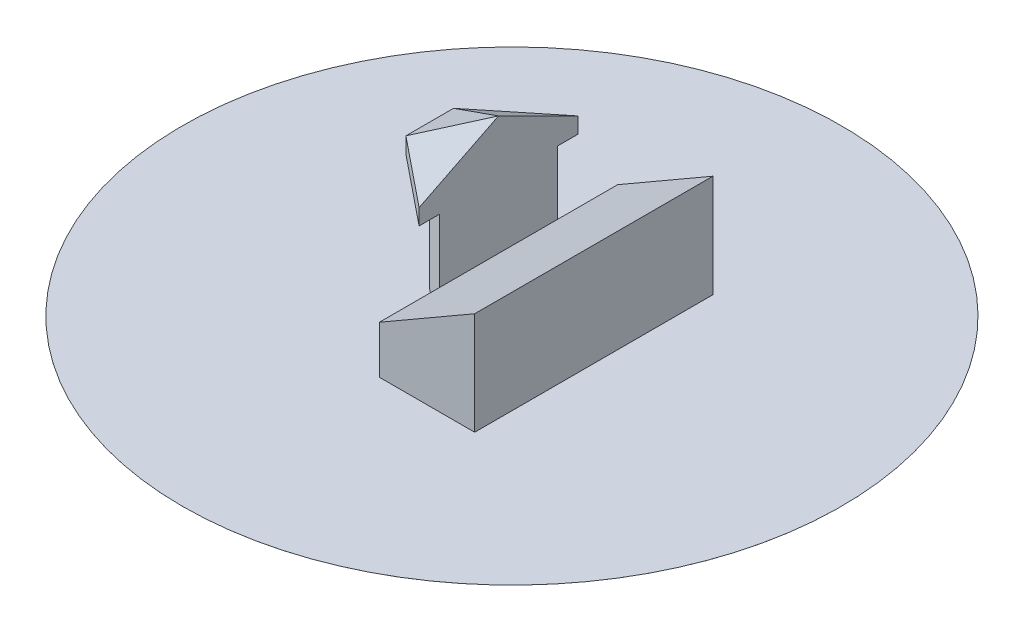
ISO-10303-21;
HEADER;
FILE_DESCRIPTION(('STEP AP214'),'2;1');
FILE_NAME('part.step','',(''),(''),'','','');
FILE_SCHEMA(('AUTOMOTIVE_DESIGN { 1 0 10303 214 1 1 1 1 }'));
ENDSEC;
DATA;
#1=APPLICATION_CONTEXT('core data for automotive mechanical design processes');
#2=APPLICATION_PROTOCOL_DEFINITION('international standard','automotive_design',2000,#1);
#3=PRODUCT_CONTEXT('',#1,'mechanical');
#4=PRODUCT('Part','Part','',(#3));
#5=PRODUCT_RELATED_PRODUCT_CATEGORY('part','',(#4));
#6=PRODUCT_DEFINITION_FORMATION('','',#4);
#7=PRODUCT_DEFINITION_CONTEXT('part definition',#1,'design');
#8=PRODUCT_DEFINITION('design','',#6,#7);
#9=PRODUCT_DEFINITION_SHAPE('','',#8);
#10=(LENGTH_UNIT() NAMED_UNIT(*) SI_UNIT(.MILLI.,.METRE.));
#11=(NAMED_UNIT(*) PLANE_ANGLE_UNIT() SI_UNIT($,.RADIAN.));
#12=(NAMED_UNIT(*) SI_UNIT($,.STERADIAN.) SOLID_ANGLE_UNIT());
#13=UNCERTAINTY_MEASURE_WITH_UNIT(LENGTH_MEASURE(1.E-05),#10,'distance_accuracy_value','');
#14=(GEOMETRIC_REPRESENTATION_CONTEXT(3) GLOBAL_UNCERTAINTY_ASSIGNED_CONTEXT((#13)) GLOBAL_UNIT_ASSIGNED_CONTEXT((#10,
#11,#12)) REPRESENTATION_CONTEXT('',''));
#15=CARTESIAN_POINT('',(0.,0.,0.));
#16=DIRECTION('',(0.,0.,1.));
#17=DIRECTION('',(1.,0.,0.));
#18=AXIS2_PLACEMENT_3D('',#15,#16,#17);
#19=CARTESIAN_POINT('',(0.,0.,75.));
#20=DIRECTION('',(1.,0.,0.));
#21=DIRECTION('',(0.,0.,-1.));
#22=AXIS2_PLACEMENT_3D('',#19,#20,#21);
#23=PLANE('',#22);
#24=DIRECTION('',(0.,-1.,0.));
#25=VECTOR('',#24,1.);
#26=CARTESIAN_POINT('',(0.,0.,-75.));
#27=LINE('',#26,#25);
#28=CARTESIAN_POINT('',(0.,30.,-75.));
#29=VERTEX_POINT('',#28);
#30=CARTESIAN_POINT('',(0.,0.01,-75.));
#31=VERTEX_POINT('',#30);
#32=EDGE_CURVE('E192',#29,#31,#27,.T.);
#33=ORIENTED_EDGE('',*,*,#32,.T.);
#34=DIRECTION('',(0.,0.,1.));
#35=VECTOR('',#34,1.);
#36=CARTESIAN_POINT('',(0.,0.01,75.));
#37=LINE('',#36,#35);
#38=CARTESIAN_POINT('',(0.,0.0100000000000031,-37.1417989853427));
#39=VERTEX_POINT('',#38);
#40=EDGE_CURVE('E257',#31,#39,#37,.T.);
#41=ORIENTED_EDGE('',*,*,#40,.T.);
#42=DIRECTION('',(0.,-1.,0.));
#43=VECTOR('',#42,1.);
#44=CARTESIAN_POINT('',(0.,70.,-37.1417989853427));
#45=LINE('',#44,#43);
#46=CARTESIAN_POINT('',(0.,30.,-37.1417989853427));
#47=VERTEX_POINT('',#46);
#48=EDGE_CURVE('E42',#47,#39,#45,.T.);
#49=ORIENTED_EDGE('',*,*,#48,.F.);
#50=DIRECTION('',(0.,0.,-1.));
#51=VECTOR('',#50,1.);
#52=CARTESIAN_POINT('',(0.,30.,75.));
#53=LINE('',#52,#51);
#54=EDGE_CURVE('E187',#47,#29,#53,.T.);
#55=ORIENTED_EDGE('',*,*,#54,.T.);
#56=EDGE_LOOP('',(#33,#41,#49,#55));
#57=FACE_BOUND('',#56,.T.);
#58=ADVANCED_FACE('F34',(#57),#23,.F.);
#59=CARTESIAN_POINT('',(60.,64.6410161513771,75.));
#60=DIRECTION('',(-1.,0.,0.));
#61=DIRECTION('',(0.,-1.,0.));
#62=AXIS2_PLACEMENT_3D('',#59,#60,#61);
#63=PLANE('',#62);
#64=DIRECTION('',(0.,1.,0.));
#65=VECTOR('',#64,1.);
#66=CARTESIAN_POINT('',(60.,64.6410161513771,75.));
#67=LINE('',#66,#65);
#68=CARTESIAN_POINT('',(60.,0.00999999999999612,75.));
#69=VERTEX_POINT('',#68);
#70=CARTESIAN_POINT('',(60.,64.6410161513771,75.));
#71=VERTEX_POINT('',#70);
#72=EDGE_CURVE('E213',#69,#71,#67,.T.);
#73=ORIENTED_EDGE('',*,*,#72,.F.);
#74=DIRECTION('',(0.,0.,-1.));
#75=VECTOR('',#74,1.);
#76=CARTESIAN_POINT('',(60.,0.00999999999999612,75.));
#77=LINE('',#76,#75);
#78=CARTESIAN_POINT('',(60.,0.01,-75.));
#79=VERTEX_POINT('',#78);
#80=EDGE_CURVE('E123',#69,#79,#77,.T.);
#81=ORIENTED_EDGE('',*,*,#80,.T.);
#82=DIRECTION('',(0.,1.,0.));
#83=VECTOR('',#82,1.);
#84=CARTESIAN_POINT('',(60.,64.6410161513771,-75.));
#85=LINE('',#84,#83);
#86=CARTESIAN_POINT('',(60.,64.6410161513771,-75.));
#87=VERTEX_POINT('',#86);
#88=EDGE_CURVE('E207',#79,#87,#85,.T.);
#89=ORIENTED_EDGE('',*,*,#88,.T.);
#90=DIRECTION('',(0.,0.,-1.));
#91=VECTOR('',#90,1.);
#92=CARTESIAN_POINT('',(60.,64.6410161513771,75.));
#93=LINE('',#92,#91);
#94=EDGE_CURVE('E204',#71,#87,#93,.T.);
#95=ORIENTED_EDGE('',*,*,#94,.F.);
#96=EDGE_LOOP('',(#73,#81,#89,#95));
#97=FACE_BOUND('',#96,.T.);
#98=ADVANCED_FACE('F279',(#97),#63,.F.);
#99=CARTESIAN_POINT('',(0.,30.,75.));
#100=DIRECTION('',(0.499999999999995,-0.866025403784441,0.));
#101=DIRECTION('',(0.866025403784441,0.499999999999995,0.));
#102=AXIS2_PLACEMENT_3D('',#99,#100,#101);
#103=PLANE('',#102);
#104=DIRECTION('',(-0.866025403784441,-0.499999999999995,0.));
#105=VECTOR('',#104,1.);
#106=CARTESIAN_POINT('',(0.,30.,-75.));
#107=LINE('',#106,#105);
#108=EDGE_CURVE('E201',#87,#29,#107,.T.);
#109=ORIENTED_EDGE('',*,*,#108,.T.);
#110=ORIENTED_EDGE('',*,*,#54,.F.);
#111=CARTESIAN_POINT('',(0.,30.,37.1417989853427));
#112=VERTEX_POINT('',#111);
#113=EDGE_CURVE('E195',#112,#47,#53,.T.);
#114=ORIENTED_EDGE('',*,*,#113,.F.);
#115=CARTESIAN_POINT('',(0.,30.,75.));
#116=VERTEX_POINT('',#115);
#117=EDGE_CURVE('E198',#116,#112,#53,.T.);
#118=ORIENTED_EDGE('',*,*,#117,.F.);
#119=DIRECTION('',(-0.866025403784441,-0.499999999999995,0.));
#120=VECTOR('',#119,1.);
#121=CARTESIAN_POINT('',(0.,30.,75.));
#122=LINE('',#121,#120);
#123=EDGE_CURVE('E57',#71,#116,#122,.T.);
#124=ORIENTED_EDGE('',*,*,#123,.F.);
#125=ORIENTED_EDGE('',*,*,#94,.T.);
#126=EDGE_LOOP('',(#109,#110,#114,#118,#124,#125));
#127=FACE_BOUND('',#126,.T.);
#128=ADVANCED_FACE('F202',(#127),#103,.F.);
#129=DIRECTION('',(0.,-1.,0.));
#130=VECTOR('',#129,1.);
#131=CARTESIAN_POINT('',(0.,70.,37.1417989853427));
#132=LINE('',#131,#130);
#133=CARTESIAN_POINT('',(0.,0.00999999999999612,37.1417989853427));
#134=VERTEX_POINT('',#133);
#135=EDGE_CURVE('E222',#112,#134,#132,.T.);
#136=ORIENTED_EDGE('',*,*,#135,.T.);
#137=DIRECTION('',(0.,0.,1.));
#138=VECTOR('',#137,1.);
#139=CARTESIAN_POINT('',(0.,0.01,75.));
#140=LINE('',#139,#138);
#141=CARTESIAN_POINT('',(0.,0.01,75.));
#142=VERTEX_POINT('',#141);
#143=EDGE_CURVE('E250',#134,#142,#140,.T.);
#144=ORIENTED_EDGE('',*,*,#143,.T.);
#145=DIRECTION('',(0.,-1.,0.));
#146=VECTOR('',#145,1.);
#147=CARTESIAN_POINT('',(0.,0.,75.));
#148=LINE('',#147,#146);
#149=EDGE_CURVE('E196',#116,#142,#148,.T.);
#150=ORIENTED_EDGE('',*,*,#149,.F.);
#151=ORIENTED_EDGE('',*,*,#117,.T.);
#152=EDGE_LOOP('',(#136,#144,#150,#151));
#153=FACE_BOUND('',#152,.T.);
#154=ADVANCED_FACE('F281',(#153),#23,.F.);
#155=CARTESIAN_POINT('',(0.,0.,75.));
#156=DIRECTION('',(0.,0.,-1.));
#157=DIRECTION('',(-1.,0.,0.));
#158=AXIS2_PLACEMENT_3D('',#155,#156,#157);
#159=PLANE('',#158);
#160=ORIENTED_EDGE('',*,*,#149,.T.);
#161=DIRECTION('',(1.,0.,0.));
#162=VECTOR('',#161,1.);
#163=CARTESIAN_POINT('',(0.,0.01,75.));
#164=LINE('',#163,#162);
#165=EDGE_CURVE('E118',#142,#69,#164,.T.);
#166=ORIENTED_EDGE('',*,*,#165,.T.);
#167=ORIENTED_EDGE('',*,*,#72,.T.);
#168=ORIENTED_EDGE('',*,*,#123,.T.);
#169=EDGE_LOOP('',(#160,#166,#167,#168));
#170=FACE_BOUND('',#169,.T.);
#171=ADVANCED_FACE('F289',(#170),#159,.F.);
#172=CARTESIAN_POINT('',(0.,0.,-75.));
#173=DIRECTION('',(0.,0.,-1.));
#174=DIRECTION('',(-1.,0.,0.));
#175=AXIS2_PLACEMENT_3D('',#172,#173,#174);
#176=PLANE('',#175);
#177=DIRECTION('',(1.,0.,0.));
#178=VECTOR('',#177,1.);
#179=CARTESIAN_POINT('',(0.,0.01,-75.));
#180=LINE('',#179,#178);
#181=EDGE_CURVE('E212',#31,#79,#180,.T.);
#182=ORIENTED_EDGE('',*,*,#181,.F.);
#183=ORIENTED_EDGE('',*,*,#32,.F.);
#184=ORIENTED_EDGE('',*,*,#108,.F.);
#185=ORIENTED_EDGE('',*,*,#88,.F.);
#186=EDGE_LOOP('',(#182,#183,#184,#185));
#187=FACE_BOUND('',#186,.T.);
#188=ADVANCED_FACE('F210',(#187),#176,.T.);
#189=CARTESIAN_POINT('',(0.,70.,-37.1417989853427));
#190=DIRECTION('',(-1.,0.,0.));
#191=DIRECTION('',(0.,0.,1.));
#192=AXIS2_PLACEMENT_3D('',#189,#190,#191);
#193=PLANE('',#192);
#194=CARTESIAN_POINT('',(0.,70.,37.1417989853427));
#195=VERTEX_POINT('',#194);
#196=EDGE_CURVE('E164',#195,#112,#132,.T.);
#197=ORIENTED_EDGE('',*,*,#196,.T.);
#198=ORIENTED_EDGE('',*,*,#113,.T.);
#199=CARTESIAN_POINT('',(0.,70.,-37.1417989853427));
#200=VERTEX_POINT('',#199);
#201=EDGE_CURVE('E237',#200,#47,#45,.T.);
#202=ORIENTED_EDGE('',*,*,#201,.F.);
#203=DIRECTION('',(0.,0.,-1.));
#204=VECTOR('',#203,1.);
#205=CARTESIAN_POINT('',(0.,70.,50.));
#206=LINE('',#205,#204);
#207=CARTESIAN_POINT('',(0.,70.,-50.));
#208=VERTEX_POINT('',#207);
#209=EDGE_CURVE('E132',#200,#208,#206,.T.);
#210=ORIENTED_EDGE('',*,*,#209,.T.);
#211=DIRECTION('',(0.,-1.,0.));
#212=VECTOR('',#211,1.);
#213=CARTESIAN_POINT('',(0.,80.,-50.));
#214=LINE('',#213,#212);
#215=CARTESIAN_POINT('',(0.,80.,-50.));
#216=VERTEX_POINT('',#215);
#217=EDGE_CURVE('E93',#216,#208,#214,.T.);
#218=ORIENTED_EDGE('',*,*,#217,.F.);
#219=DIRECTION('',(0.,0.447213595499953,0.894427190999918));
#220=VECTOR('',#219,1.);
#221=CARTESIAN_POINT('',(0.,80.,-50.));
#222=LINE('',#221,#220);
#223=CARTESIAN_POINT('',(0.,105.,0.));
#224=VERTEX_POINT('',#223);
#225=EDGE_CURVE('E113',#216,#224,#222,.T.);
#226=ORIENTED_EDGE('',*,*,#225,.T.);
#227=DIRECTION('',(0.,0.447213595499953,-0.894427190999918));
#228=VECTOR('',#227,1.);
#229=CARTESIAN_POINT('',(0.,80.,50.));
#230=LINE('',#229,#228);
#231=CARTESIAN_POINT('',(0.,80.,50.));
#232=VERTEX_POINT('',#231);
#233=EDGE_CURVE('E120',#232,#224,#230,.T.);
#234=ORIENTED_EDGE('',*,*,#233,.F.);
#235=DIRECTION('',(0.,-1.,0.));
#236=VECTOR('',#235,1.);
#237=CARTESIAN_POINT('',(0.,80.,50.));
#238=LINE('',#237,#236);
#239=CARTESIAN_POINT('',(0.,70.,50.));
#240=VERTEX_POINT('',#239);
#241=EDGE_CURVE('E148',#232,#240,#238,.T.);
#242=ORIENTED_EDGE('',*,*,#241,.T.);
#243=EDGE_CURVE('E135',#240,#195,#206,.T.);
#244=ORIENTED_EDGE('',*,*,#243,.T.);
#245=EDGE_LOOP('',(#197,#198,#202,#210,#218,#226,#234,#242,#244));
#246=FACE_BOUND('',#245,.T.);
#247=ADVANCED_FACE('F160',(#246),#193,.F.);
#248=CARTESIAN_POINT('',(-33.3012701892219,70.,-10.2247027539975));
#249=DIRECTION('',(1.,0.,0.));
#250=DIRECTION('',(0.,0.,-1.));
#251=AXIS2_PLACEMENT_3D('',#248,#249,#250);
#252=PLANE('',#251);
#253=DIRECTION('',(0.,-1.,0.));
#254=VECTOR('',#253,1.);
#255=CARTESIAN_POINT('',(-33.3012701892219,70.,-10.2247027539975));
#256=LINE('',#255,#254);
#257=CARTESIAN_POINT('',(-33.3012701892219,70.,-10.2247027539975));
#258=VERTEX_POINT('',#257);
#259=CARTESIAN_POINT('',(-33.3012701892219,0.00999999999999612,-10.2247027539975));
#260=VERTEX_POINT('',#259);
#261=EDGE_CURVE('E313',#258,#260,#256,.T.);
#262=ORIENTED_EDGE('',*,*,#261,.T.);
#263=DIRECTION('',(0.,0.,1.));
#264=VECTOR('',#263,1.);
#265=CARTESIAN_POINT('',(-33.3012701892219,0.00999999999999612,-10.2247027539975));
#266=LINE('',#265,#264);
#267=CARTESIAN_POINT('',(-33.3012701892219,0.00999999999999612,10.2247027539975));
#268=VERTEX_POINT('',#267);
#269=EDGE_CURVE('E49',#260,#268,#266,.T.);
#270=ORIENTED_EDGE('',*,*,#269,.T.);
#271=DIRECTION('',(0.,-1.,0.));
#272=VECTOR('',#271,1.);
#273=CARTESIAN_POINT('',(-33.3012701892219,70.,10.2247027539975));
#274=LINE('',#273,#272);
#275=CARTESIAN_POINT('',(-33.3012701892219,70.,10.2247027539975));
#276=VERTEX_POINT('',#275);
#277=EDGE_CURVE('E232',#276,#268,#274,.T.);
#278=ORIENTED_EDGE('',*,*,#277,.F.);
#279=DIRECTION('',(0.,0.,1.));
#280=VECTOR('',#279,1.);
#281=CARTESIAN_POINT('',(-33.3012701892219,70.,-10.2247027539975));
#282=LINE('',#281,#280);
#283=EDGE_CURVE('E242',#258,#276,#282,.T.);
#284=ORIENTED_EDGE('',*,*,#283,.F.);
#285=EDGE_LOOP('',(#262,#270,#278,#284));
#286=FACE_BOUND('',#285,.T.);
#287=ADVANCED_FACE('F310',(#286),#252,.F.);
#288=CARTESIAN_POINT('',(-33.3012701892219,70.,10.2247027539975));
#289=DIRECTION('',(0.628618557093712,0.,-0.777713771047819));
#290=DIRECTION('',(-0.777713771047819,0.,-0.628618557093712));
#291=AXIS2_PLACEMENT_3D('',#288,#289,#290);
#292=PLANE('',#291);
#293=ORIENTED_EDGE('',*,*,#277,.T.);
#294=DIRECTION('',(0.777713771047819,0.,0.628618557093712));
#295=VECTOR('',#294,1.);
#296=CARTESIAN_POINT('',(-33.3012701892219,0.00999999999999612,10.2247027539975));
#297=LINE('',#296,#295);
#298=EDGE_CURVE('E254',#268,#134,#297,.T.);
#299=ORIENTED_EDGE('',*,*,#298,.T.);
#300=ORIENTED_EDGE('',*,*,#135,.F.);
#301=ORIENTED_EDGE('',*,*,#196,.F.);
#302=DIRECTION('',(0.777713771047819,0.,0.628618557093712));
#303=VECTOR('',#302,1.);
#304=CARTESIAN_POINT('',(-33.3012701892219,70.,10.2247027539975));
#305=LINE('',#304,#303);
#306=EDGE_CURVE('E156',#276,#195,#305,.T.);
#307=ORIENTED_EDGE('',*,*,#306,.F.);
#308=EDGE_LOOP('',(#293,#299,#300,#301,#307));
#309=FACE_BOUND('',#308,.T.);
#310=ADVANCED_FACE('F302',(#309),#292,.F.);
#311=CARTESIAN_POINT('',(0.,70.,-37.1417989853427));
#312=DIRECTION('',(0.628618557093712,0.,0.777713771047819));
#313=DIRECTION('',(0.777713771047819,0.,-0.628618557093712));
#314=AXIS2_PLACEMENT_3D('',#311,#312,#313);
#315=PLANE('',#314);
#316=ORIENTED_EDGE('',*,*,#48,.T.);
#317=DIRECTION('',(-0.777713771047819,0.,0.628618557093712));
#318=VECTOR('',#317,1.);
#319=CARTESIAN_POINT('',(0.,0.00999999999999612,-37.1417989853427));
#320=LINE('',#319,#318);
#321=EDGE_CURVE('E12',#39,#260,#320,.T.);
#322=ORIENTED_EDGE('',*,*,#321,.T.);
#323=ORIENTED_EDGE('',*,*,#261,.F.);
#324=DIRECTION('',(-0.777713771047819,0.,0.628618557093712));
#325=VECTOR('',#324,1.);
#326=CARTESIAN_POINT('',(0.,70.,-37.1417989853427));
#327=LINE('',#326,#325);
#328=EDGE_CURVE('E317',#200,#258,#327,.T.);
#329=ORIENTED_EDGE('',*,*,#328,.F.);
#330=ORIENTED_EDGE('',*,*,#201,.T.);
#331=EDGE_LOOP('',(#316,#322,#323,#329,#330));
#332=FACE_BOUND('',#331,.T.);
#333=ADVANCED_FACE('F322',(#332),#315,.F.);
#334=CARTESIAN_POINT('',(0.,70.,-50.));
#335=DIRECTION('',(0.,1.,0.));
#336=DIRECTION('',(0.,0.,1.));
#337=AXIS2_PLACEMENT_3D('',#334,#335,#336);
#338=PLANE('',#337);
#339=ORIENTED_EDGE('',*,*,#283,.T.);
#340=ORIENTED_EDGE('',*,*,#306,.T.);
#341=ORIENTED_EDGE('',*,*,#243,.F.);
#342=DIRECTION('',(0.777713771047819,0.,0.628618557093712));
#343=VECTOR('',#342,1.);
#344=CARTESIAN_POINT('',(-43.3012701892219,70.,15.));
#345=LINE('',#344,#343);
#346=CARTESIAN_POINT('',(-43.3012701892219,70.,15.));
#347=VERTEX_POINT('',#346);
#348=EDGE_CURVE('E114',#347,#240,#345,.T.);
#349=ORIENTED_EDGE('',*,*,#348,.F.);
#350=DIRECTION('',(0.,0.,1.));
#351=VECTOR('',#350,1.);
#352=CARTESIAN_POINT('',(-43.3012701892219,70.,-15.));
#353=LINE('',#352,#351);
#354=CARTESIAN_POINT('',(-43.3012701892219,70.,-15.));
#355=VERTEX_POINT('',#354);
#356=EDGE_CURVE('E139',#355,#347,#353,.T.);
#357=ORIENTED_EDGE('',*,*,#356,.F.);
#358=DIRECTION('',(-0.777713771047819,0.,0.628618557093712));
#359=VECTOR('',#358,1.);
#360=CARTESIAN_POINT('',(0.,70.,-50.));
#361=LINE('',#360,#359);
#362=EDGE_CURVE('E89',#208,#355,#361,.T.);
#363=ORIENTED_EDGE('',*,*,#362,.F.);
#364=ORIENTED_EDGE('',*,*,#209,.F.);
#365=ORIENTED_EDGE('',*,*,#328,.T.);
#366=EDGE_LOOP('',(#339,#340,#341,#349,#357,#363,#364,#365));
#367=FACE_BOUND('',#366,.T.);
#368=ADVANCED_FACE('F152',(#367),#338,.F.);
#369=CARTESIAN_POINT('',(0.,80.,-50.));
#370=DIRECTION('',(0.628618557093712,0.,0.777713771047819));
#371=DIRECTION('',(0.777713771047819,0.,-0.628618557093712));
#372=AXIS2_PLACEMENT_3D('',#369,#370,#371);
#373=PLANE('',#372);
#374=ORIENTED_EDGE('',*,*,#362,.T.);
#375=DIRECTION('',(0.,-1.,0.));
#376=VECTOR('',#375,1.);
#377=CARTESIAN_POINT('',(-43.3012701892219,80.,-15.));
#378=LINE('',#377,#376);
#379=CARTESIAN_POINT('',(-43.3012701892219,80.,-15.));
#380=VERTEX_POINT('',#379);
#381=EDGE_CURVE('E80',#380,#355,#378,.T.);
#382=ORIENTED_EDGE('',*,*,#381,.F.);
#383=DIRECTION('',(-0.777713771047819,0.,0.628618557093712));
#384=VECTOR('',#383,1.);
#385=CARTESIAN_POINT('',(0.,80.,-50.));
#386=LINE('',#385,#384);
#387=EDGE_CURVE('E85',#216,#380,#386,.T.);
#388=ORIENTED_EDGE('',*,*,#387,.F.);
#389=ORIENTED_EDGE('',*,*,#217,.T.);
#390=EDGE_LOOP('',(#374,#382,#388,#389));
#391=FACE_BOUND('',#390,.T.);
#392=ADVANCED_FACE('F82',(#391),#373,.F.);
#393=CARTESIAN_POINT('',(-43.3012701892219,80.,-15.));
#394=DIRECTION('',(1.,0.,0.));
#395=DIRECTION('',(0.,0.,-1.));
#396=AXIS2_PLACEMENT_3D('',#393,#394,#395);
#397=PLANE('',#396);
#398=ORIENTED_EDGE('',*,*,#356,.T.);
#399=DIRECTION('',(0.,-1.,0.));
#400=VECTOR('',#399,1.);
#401=CARTESIAN_POINT('',(-43.3012701892219,80.,15.));
#402=LINE('',#401,#400);
#403=CARTESIAN_POINT('',(-43.3012701892219,80.,15.));
#404=VERTEX_POINT('',#403);
#405=EDGE_CURVE('E94',#404,#347,#402,.T.);
#406=ORIENTED_EDGE('',*,*,#405,.F.);
#407=DIRECTION('',(0.,0.,1.));
#408=VECTOR('',#407,1.);
#409=CARTESIAN_POINT('',(-43.3012701892219,80.,15.));
#410=LINE('',#409,#408);
#411=EDGE_CURVE('E97',#380,#404,#410,.T.);
#412=ORIENTED_EDGE('',*,*,#411,.F.);
#413=ORIENTED_EDGE('',*,*,#381,.T.);
#414=EDGE_LOOP('',(#398,#406,#412,#413));
#415=FACE_BOUND('',#414,.T.);
#416=ADVANCED_FACE('F98',(#415),#397,.F.);
#417=CARTESIAN_POINT('',(-43.3012701892219,80.,15.));
#418=DIRECTION('',(0.628618557093712,0.,-0.777713771047819));
#419=DIRECTION('',(-0.777713771047819,0.,-0.628618557093712));
#420=AXIS2_PLACEMENT_3D('',#417,#418,#419);
#421=PLANE('',#420);
#422=ORIENTED_EDGE('',*,*,#348,.T.);
#423=ORIENTED_EDGE('',*,*,#241,.F.);
#424=DIRECTION('',(0.777713771047819,0.,0.628618557093712));
#425=VECTOR('',#424,1.);
#426=CARTESIAN_POINT('',(-43.3012701892219,80.,15.));
#427=LINE('',#426,#425);
#428=EDGE_CURVE('E105',#404,#232,#427,.T.);
#429=ORIENTED_EDGE('',*,*,#428,.F.);
#430=ORIENTED_EDGE('',*,*,#405,.T.);
#431=EDGE_LOOP('',(#422,#423,#429,#430));
#432=FACE_BOUND('',#431,.T.);
#433=ADVANCED_FACE('F145',(#432),#421,.F.);
#434=CARTESIAN_POINT('',(0.,105.,0.));
#435=DIRECTION('',(0.339950051825039,-0.84115823113807,-0.420579115569029));
#436=DIRECTION('',(0.,0.447213595499953,-0.894427190999918));
#437=AXIS2_PLACEMENT_3D('',#434,#435,#436);
#438=PLANE('',#437);
#439=ORIENTED_EDGE('',*,*,#233,.T.);
#440=DIRECTION('',(0.829501895413999,0.478913142610571,-0.287347885566346));
#441=VECTOR('',#440,1.);
#442=CARTESIAN_POINT('',(-43.3012701892219,80.,15.));
#443=LINE('',#442,#441);
#444=EDGE_CURVE('E116',#404,#224,#443,.T.);
#445=ORIENTED_EDGE('',*,*,#444,.F.);
#446=ORIENTED_EDGE('',*,*,#428,.T.);
#447=EDGE_LOOP('',(#439,#445,#446));
#448=FACE_BOUND('',#447,.T.);
#449=ADVANCED_FACE('F244',(#448),#438,.F.);
#450=CARTESIAN_POINT('',(-43.3012701892219,80.,15.));
#451=DIRECTION('',(0.499999999999995,-0.866025403784442,0.));
#452=DIRECTION('',(0.866025403784442,0.499999999999995,0.));
#453=AXIS2_PLACEMENT_3D('',#450,#451,#452);
#454=PLANE('',#453);
#455=ORIENTED_EDGE('',*,*,#444,.T.);
#456=DIRECTION('',(0.829501895413999,0.478913142610571,0.287347885566346));
#457=VECTOR('',#456,1.);
#458=CARTESIAN_POINT('',(-43.3012701892219,80.,-15.));
#459=LINE('',#458,#457);
#460=EDGE_CURVE('E111',#380,#224,#459,.T.);
#461=ORIENTED_EDGE('',*,*,#460,.F.);
#462=ORIENTED_EDGE('',*,*,#411,.T.);
#463=EDGE_LOOP('',(#455,#461,#462));
#464=FACE_BOUND('',#463,.T.);
#465=ADVANCED_FACE('F115',(#464),#454,.F.);
#466=CARTESIAN_POINT('',(-43.3012701892219,80.,-15.));
#467=DIRECTION('',(0.339950051825039,-0.84115823113807,0.420579115569029));
#468=DIRECTION('',(0.,-0.447213595499953,-0.894427190999918));
#469=AXIS2_PLACEMENT_3D('',#466,#467,#468);
#470=PLANE('',#469);
#471=ORIENTED_EDGE('',*,*,#460,.T.);
#472=ORIENTED_EDGE('',*,*,#225,.F.);
#473=ORIENTED_EDGE('',*,*,#387,.T.);
#474=EDGE_LOOP('',(#471,#472,#473));
#475=FACE_BOUND('',#474,.T.);
#476=ADVANCED_FACE('F110',(#475),#470,.F.);
#477=CARTESIAN_POINT('',(8.34936490538902,0.01,-0.109485549377633));
#478=DIRECTION('',(0.,1.,0.));
#479=DIRECTION('',(0.,0.,1.));
#480=AXIS2_PLACEMENT_3D('',#477,#478,#479);
#481=PLANE('',#480);
#482=CARTESIAN_POINT('',(8.34936490538902,0.01,-0.109485549377633));
#483=DIRECTION('',(0.,1.,0.));
#484=DIRECTION('',(0.,0.,1.));
#485=AXIS2_PLACEMENT_3D('',#482,#483,#484);
#486=CIRCLE('',#485,207.5);
#487=CARTESIAN_POINT('',(8.34936490538902,0.01,207.390514450622));
#488=VERTEX_POINT('',#487);
#489=EDGE_CURVE('E260',#488,#488,#486,.T.);
#490=ORIENTED_EDGE('',*,*,#489,.T.);
#491=EDGE_LOOP('',(#490));
#492=FACE_BOUND('',#491,.T.);
#493=ORIENTED_EDGE('',*,*,#165,.F.);
#494=ORIENTED_EDGE('',*,*,#143,.F.);
#495=ORIENTED_EDGE('',*,*,#298,.F.);
#496=ORIENTED_EDGE('',*,*,#269,.F.);
#497=ORIENTED_EDGE('',*,*,#321,.F.);
#498=ORIENTED_EDGE('',*,*,#40,.F.);
#499=ORIENTED_EDGE('',*,*,#181,.T.);
#500=ORIENTED_EDGE('',*,*,#80,.F.);
#501=EDGE_LOOP('',(#493,#494,#495,#496,#497,#498,#499,#500));
#502=FACE_BOUND('',#501,.T.);
#503=ADVANCED_FACE('F267',(#492,#502),#481,.T.);
#504=CARTESIAN_POINT('',(8.34936490538902,0.01,-0.109485549377633));
#505=DIRECTION('',(0.,-1.,0.));
#506=DIRECTION('',(0.,0.,-1.));
#507=AXIS2_PLACEMENT_3D('',#504,#505,#506);
#508=CYLINDRICAL_SURFACE('',#507,207.5);
#509=ORIENTED_EDGE('',*,*,#489,.F.);
#510=EDGE_LOOP('',(#509));
#511=FACE_BOUND('',#510,.T.);
#512=CARTESIAN_POINT('',(8.34936490538902,0.,-0.109485549377633));
#513=DIRECTION('',(0.,1.,0.));
#514=DIRECTION('',(0.,0.,1.));
#515=AXIS2_PLACEMENT_3D('',#512,#513,#514);
#516=CIRCLE('',#515,207.5);
#517=CARTESIAN_POINT('',(8.34936490538902,0.,207.390514450622));
#518=VERTEX_POINT('',#517);
#519=EDGE_CURVE('E261',#518,#518,#516,.T.);
#520=ORIENTED_EDGE('',*,*,#519,.T.);
#521=EDGE_LOOP('',(#520));
#522=FACE_BOUND('',#521,.T.);
#523=ADVANCED_FACE('F269',(#511,#522),#508,.T.);
#524=CARTESIAN_POINT('',(60.,0.,75.));
#525=DIRECTION('',(0.,1.,0.));
#526=DIRECTION('',(-1.,0.,0.));
#527=AXIS2_PLACEMENT_3D('',#524,#525,#526);
#528=PLANE('',#527);
#529=ORIENTED_EDGE('',*,*,#519,.F.);
#530=EDGE_LOOP('',(#529));
#531=FACE_BOUND('',#530,.T.);
#532=ADVANCED_FACE('F36',(#531),#528,.F.);
#533=CLOSED_SHELL('',(#58,#98,#128,#154,#171,#188,#247,#287,#310,#333,#368,#392,#416,#433,#449,
#465,#476,#503,#523,#532));
#534=MANIFOLD_SOLID_BREP('B2',#533);
#535=ADVANCED_BREP_SHAPE_REPRESENTATION('',(#18,#534),#14);
#536=SHAPE_DEFINITION_REPRESENTATION(#9,#535);
ENDSEC;
END-ISO-10303-21;
